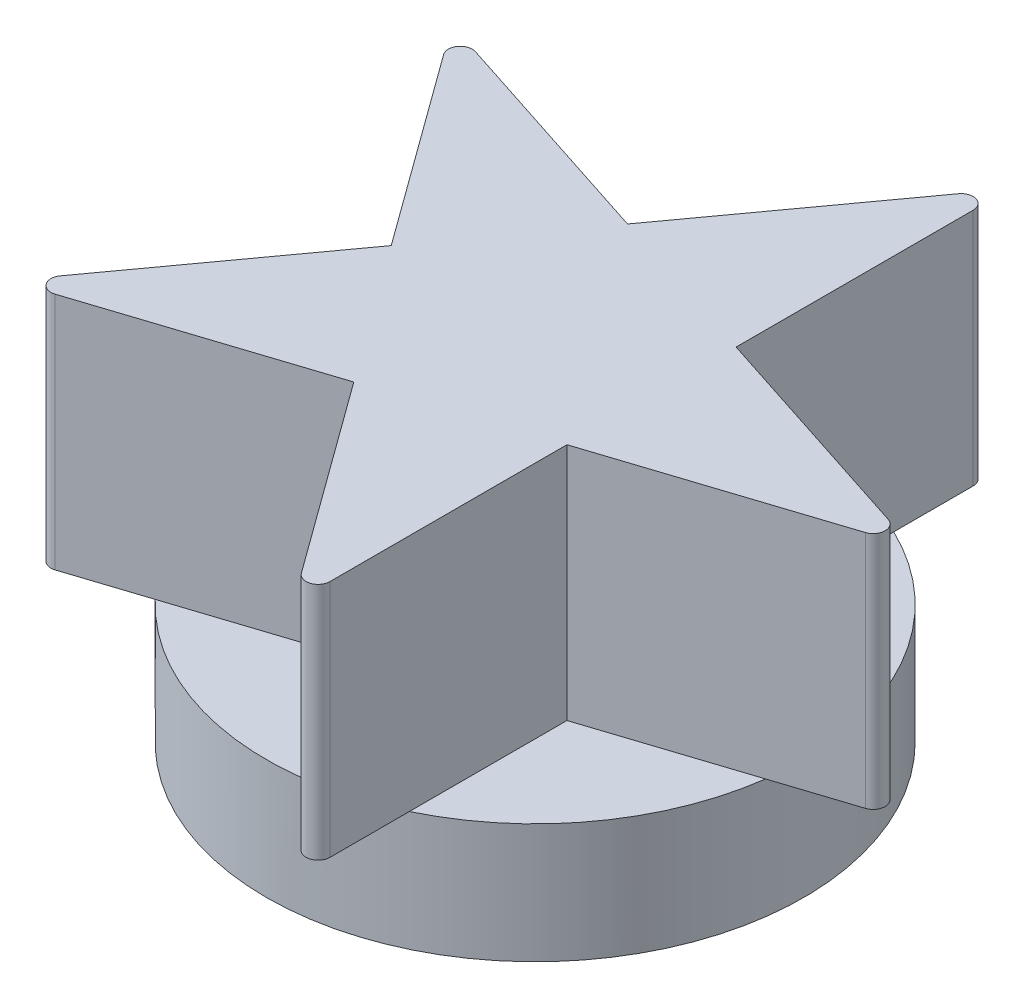
ISO-10303-21;
HEADER;
FILE_DESCRIPTION(('STEP AP214'),'2;1');
FILE_NAME('part.step','',(''),(''),'','','');
FILE_SCHEMA(('AUTOMOTIVE_DESIGN { 1 0 10303 214 1 1 1 1 }'));
ENDSEC;
DATA;
#1=APPLICATION_CONTEXT('core data for automotive mechanical design processes');
#2=APPLICATION_PROTOCOL_DEFINITION('international standard','automotive_design',2000,#1);
#3=PRODUCT_CONTEXT('',#1,'mechanical');
#4=PRODUCT('Part','Part','',(#3));
#5=PRODUCT_RELATED_PRODUCT_CATEGORY('part','',(#4));
#6=PRODUCT_DEFINITION_FORMATION('','',#4);
#7=PRODUCT_DEFINITION_CONTEXT('part definition',#1,'design');
#8=PRODUCT_DEFINITION('design','',#6,#7);
#9=PRODUCT_DEFINITION_SHAPE('','',#8);
#10=(LENGTH_UNIT() NAMED_UNIT(*) SI_UNIT(.MILLI.,.METRE.));
#11=(NAMED_UNIT(*) PLANE_ANGLE_UNIT() SI_UNIT($,.RADIAN.));
#12=(NAMED_UNIT(*) SI_UNIT($,.STERADIAN.) SOLID_ANGLE_UNIT());
#13=UNCERTAINTY_MEASURE_WITH_UNIT(LENGTH_MEASURE(1.E-05),#10,'distance_accuracy_value','');
#14=(GEOMETRIC_REPRESENTATION_CONTEXT(3) GLOBAL_UNCERTAINTY_ASSIGNED_CONTEXT((#13)) GLOBAL_UNIT_ASSIGNED_CONTEXT((#10,
#11,#12)) REPRESENTATION_CONTEXT('',''));
#15=CARTESIAN_POINT('',(0.,0.,0.));
#16=DIRECTION('',(0.,0.,1.));
#17=DIRECTION('',(1.,0.,0.));
#18=AXIS2_PLACEMENT_3D('',#15,#16,#17);
#19=CARTESIAN_POINT('',(0.,10.,0.));
#20=DIRECTION('',(0.,1.,0.));
#21=DIRECTION('',(0.,0.,1.));
#22=AXIS2_PLACEMENT_3D('',#19,#20,#21);
#23=PLANE('',#22);
#24=DIRECTION('',(-0.587785252292473,0.,0.809016994374947));
#25=VECTOR('',#24,1.);
#26=CARTESIAN_POINT('',(-23.7105072561862,10.,16.051121377614));
#27=LINE('',#26,#25);
#28=CARTESIAN_POINT('',(-12.0486849531736,10.,0.));
#29=VERTEX_POINT('',#28);
#30=CARTESIAN_POINT('',(-19.805614986373,10.,10.6764982560555));
#31=VERTEX_POINT('',#30);
#32=EDGE_CURVE('E67',#29,#31,#27,.T.);
#33=ORIENTED_EDGE('',*,*,#32,.F.);
#34=DIRECTION('',(0.587785252292473,0.,0.809016994374947));
#35=VECTOR('',#34,1.);
#36=CARTESIAN_POINT('',(-23.7105072561862,10.,-16.0511213776141));
#37=LINE('',#36,#35);
#38=CARTESIAN_POINT('',(-19.805614986373,10.,-10.6764982560555));
#39=VERTEX_POINT('',#38);
#40=EDGE_CURVE('E11',#39,#29,#37,.T.);
#41=ORIENTED_EDGE('',*,*,#40,.F.);
#42=CARTESIAN_POINT('',(0.,10.,0.));
#43=DIRECTION('',(0.,1.,0.));
#44=DIRECTION('',(0.,0.,1.));
#45=AXIS2_PLACEMENT_3D('',#42,#43,#44);
#46=CIRCLE('',#45,22.5);
#47=EDGE_CURVE('E377',#39,#31,#46,.T.);
#48=ORIENTED_EDGE('',*,*,#47,.T.);
#49=EDGE_LOOP('',(#33,#41,#48));
#50=FACE_BOUND('',#49,.T.);
#51=ADVANCED_FACE('F41',(#50),#23,.T.);
#52=DIRECTION('',(-0.951056516295153,0.,-0.309016994374947));
#53=VECTOR('',#52,1.);
#54=CARTESIAN_POINT('',(-3.72324841040035,10.,-11.4589803375032));
#55=LINE('',#54,#53);
#56=CARTESIAN_POINT('',(-3.72324841040035,10.,-11.4589803375032));
#57=VERTEX_POINT('',#56);
#58=CARTESIAN_POINT('',(-16.2742248524718,10.,-15.5370397904874));
#59=VERTEX_POINT('',#58);
#60=EDGE_CURVE('E313',#57,#59,#55,.T.);
#61=ORIENTED_EDGE('',*,*,#60,.F.);
#62=DIRECTION('',(-0.587785252292473,0.,0.809016994374948));
#63=VECTOR('',#62,1.);
#64=CARTESIAN_POINT('',(-3.72324841040035,10.,-11.4589803375032));
#65=LINE('',#64,#63);
#66=CARTESIAN_POINT('',(4.03368162279902,10.,-22.1354785935587));
#67=VERTEX_POINT('',#66);
#68=EDGE_CURVE('E50',#67,#57,#65,.T.);
#69=ORIENTED_EDGE('',*,*,#68,.F.);
#70=EDGE_CURVE('E699',#67,#59,#46,.T.);
#71=ORIENTED_EDGE('',*,*,#70,.T.);
#72=EDGE_LOOP('',(#61,#69,#71));
#73=FACE_BOUND('',#72,.T.);
#74=ADVANCED_FACE('F399',(#73),#23,.T.);
#75=DIRECTION('',(0.,0.,-1.));
#76=VECTOR('',#75,1.);
#77=CARTESIAN_POINT('',(9.7475908869872,10.,-26.9223164628247));
#78=LINE('',#77,#76);
#79=CARTESIAN_POINT('',(9.7475908869872,10.,-7.0820393249937));
#80=VERTEX_POINT('',#79);
#81=CARTESIAN_POINT('',(9.7475908869872,10.,-20.2789169311362));
#82=VERTEX_POINT('',#81);
#83=EDGE_CURVE('E304',#80,#82,#78,.T.);
#84=ORIENTED_EDGE('',*,*,#83,.F.);
#85=DIRECTION('',(-0.951056516295154,0.,-0.309016994374948));
#86=VECTOR('',#85,1.);
#87=CARTESIAN_POINT('',(28.6168157440231,10.,-0.951056516295165));
#88=LINE('',#87,#86);
#89=CARTESIAN_POINT('',(22.2985673290587,10.,-3.00397987200947));
#90=VERTEX_POINT('',#89);
#91=EDGE_CURVE('E303',#90,#80,#88,.T.);
#92=ORIENTED_EDGE('',*,*,#91,.F.);
#93=EDGE_CURVE('E706',#90,#82,#46,.T.);
#94=ORIENTED_EDGE('',*,*,#93,.T.);
#95=EDGE_LOOP('',(#84,#92,#94));
#96=FACE_BOUND('',#95,.T.);
#97=ADVANCED_FACE('F403',(#96),#23,.T.);
#98=DIRECTION('',(0.951056516295154,0.,-0.309016994374947));
#99=VECTOR('',#98,1.);
#100=CARTESIAN_POINT('',(28.6168157440231,10.,0.951056516295165));
#101=LINE('',#100,#99);
#102=CARTESIAN_POINT('',(9.7475908869872,10.,7.08203932499369));
#103=VERTEX_POINT('',#102);
#104=CARTESIAN_POINT('',(22.2985673290586,10.,3.00397987200947));
#105=VERTEX_POINT('',#104);
#106=EDGE_CURVE('E294',#103,#105,#101,.T.);
#107=ORIENTED_EDGE('',*,*,#106,.F.);
#108=DIRECTION('',(0.,0.,-1.));
#109=VECTOR('',#108,1.);
#110=CARTESIAN_POINT('',(9.7475908869872,10.,7.08203932499369));
#111=LINE('',#110,#109);
#112=CARTESIAN_POINT('',(9.74759088698719,10.,20.2789169311362));
#113=VERTEX_POINT('',#112);
#114=EDGE_CURVE('E293',#113,#103,#111,.T.);
#115=ORIENTED_EDGE('',*,*,#114,.F.);
#116=EDGE_CURVE('E364',#113,#105,#46,.T.);
#117=ORIENTED_EDGE('',*,*,#116,.T.);
#118=EDGE_LOOP('',(#107,#115,#117));
#119=FACE_BOUND('',#118,.T.);
#120=ADVANCED_FACE('F397',(#119),#23,.T.);
#121=CARTESIAN_POINT('',(0.,10.,0.));
#122=DIRECTION('',(0.,-1.,0.));
#123=DIRECTION('',(0.,0.,-1.));
#124=AXIS2_PLACEMENT_3D('',#121,#122,#123);
#125=CYLINDRICAL_SURFACE('',#124,22.5);
#126=CARTESIAN_POINT('',(4.03368162279902,10.,22.1354785935587));
#127=VERTEX_POINT('',#126);
#128=EDGE_CURVE('E362',#127,#113,#46,.T.);
#129=ORIENTED_EDGE('',*,*,#128,.F.);
#130=CARTESIAN_POINT('',(-16.2742248524718,10.,15.5370397904874));
#131=VERTEX_POINT('',#130);
#132=EDGE_CURVE('E365',#131,#127,#46,.T.);
#133=ORIENTED_EDGE('',*,*,#132,.F.);
#134=EDGE_CURVE('E373',#31,#131,#46,.T.);
#135=ORIENTED_EDGE('',*,*,#134,.F.);
#136=ORIENTED_EDGE('',*,*,#47,.F.);
#137=EDGE_CURVE('E698',#59,#39,#46,.T.);
#138=ORIENTED_EDGE('',*,*,#137,.F.);
#139=ORIENTED_EDGE('',*,*,#70,.F.);
#140=EDGE_CURVE('E703',#82,#67,#46,.T.);
#141=ORIENTED_EDGE('',*,*,#140,.F.);
#142=ORIENTED_EDGE('',*,*,#93,.F.);
#143=EDGE_CURVE('E372',#105,#90,#46,.T.);
#144=ORIENTED_EDGE('',*,*,#143,.F.);
#145=ORIENTED_EDGE('',*,*,#116,.F.);
#146=EDGE_LOOP('',(#129,#133,#135,#136,#138,#139,#141,#142,#144,#145));
#147=FACE_BOUND('',#146,.T.);
#148=CARTESIAN_POINT('',(0.,0.,0.));
#149=DIRECTION('',(0.,1.,0.));
#150=DIRECTION('',(0.,0.,1.));
#151=AXIS2_PLACEMENT_3D('',#148,#149,#150);
#152=CIRCLE('',#151,22.5);
#153=CARTESIAN_POINT('',(0.,0.,22.5));
#154=VERTEX_POINT('',#153);
#155=EDGE_CURVE('E45',#154,#154,#152,.T.);
#156=ORIENTED_EDGE('',*,*,#155,.T.);
#157=EDGE_LOOP('',(#156));
#158=FACE_BOUND('',#157,.T.);
#159=ADVANCED_FACE('F43',(#147,#158),#125,.T.);
#160=DIRECTION('',(0.587785252292473,0.,0.809016994374948));
#161=VECTOR('',#160,1.);
#162=CARTESIAN_POINT('',(-3.72324841040036,10.,11.4589803375032));
#163=LINE('',#162,#161);
#164=CARTESIAN_POINT('',(-3.72324841040036,10.,11.4589803375032));
#165=VERTEX_POINT('',#164);
#166=EDGE_CURVE('E284',#165,#127,#163,.T.);
#167=ORIENTED_EDGE('',*,*,#166,.F.);
#168=DIRECTION('',(0.951056516295154,0.,-0.309016994374947));
#169=VECTOR('',#168,1.);
#170=CARTESIAN_POINT('',(-3.72324841040036,10.,11.4589803375032));
#171=LINE('',#170,#169);
#172=EDGE_CURVE('E283',#131,#165,#171,.T.);
#173=ORIENTED_EDGE('',*,*,#172,.F.);
#174=ORIENTED_EDGE('',*,*,#132,.T.);
#175=EDGE_LOOP('',(#167,#173,#174));
#176=FACE_BOUND('',#175,.T.);
#177=ADVANCED_FACE('F385',(#176),#23,.T.);
#178=CARTESIAN_POINT('',(0.,0.,0.));
#179=DIRECTION('',(0.,1.,0.));
#180=DIRECTION('',(0.,0.,1.));
#181=AXIS2_PLACEMENT_3D('',#178,#179,#180);
#182=PLANE('',#181);
#183=CARTESIAN_POINT('',(0.,0.,0.));
#184=DIRECTION('',(0.,-1.,0.));
#185=DIRECTION('',(0.,0.,-1.));
#186=AXIS2_PLACEMENT_3D('',#183,#184,#185);
#187=CIRCLE('',#186,21.5);
#188=CARTESIAN_POINT('',(4.83856503950974,0.,20.9484674465326));
#189=VERTEX_POINT('',#188);
#190=CARTESIAN_POINT('',(-4.83856503950294,0.,20.9484674465341));
#191=VERTEX_POINT('',#190);
#192=EDGE_CURVE('E234',#189,#191,#187,.T.);
#193=ORIENTED_EDGE('',*,*,#192,.F.);
#194=DIRECTION('',(-0.471428571428459,0.,0.881904247660097));
#195=VECTOR('',#194,1.);
#196=CARTESIAN_POINT('',(12.4726457883362,0.,6.66734693877418));
#197=LINE('',#196,#195);
#198=CARTESIAN_POINT('',(14.5514200863916,0.,2.77857142856957));
#199=VERTEX_POINT('',#198);
#200=EDGE_CURVE('E59',#199,#189,#197,.T.);
#201=ORIENTED_EDGE('',*,*,#200,.F.);
#202=CARTESIAN_POINT('',(0.,0.,-5.));
#203=DIRECTION('',(0.,-1.,0.));
#204=DIRECTION('',(0.,0.,-1.));
#205=AXIS2_PLACEMENT_3D('',#202,#203,#204);
#206=CIRCLE('',#205,16.5);
#207=CARTESIAN_POINT('',(-14.5514200863896,0.,2.77857142857328));
#208=VERTEX_POINT('',#207);
#209=EDGE_CURVE('E225',#208,#199,#206,.T.);
#210=ORIENTED_EDGE('',*,*,#209,.F.);
#211=DIRECTION('',(-0.471428571428684,0.,-0.881904247659977));
#212=VECTOR('',#211,1.);
#213=CARTESIAN_POINT('',(-12.4726457883335,0.,6.66734693877684));
#214=LINE('',#213,#212);
#215=EDGE_CURVE('E228',#191,#208,#214,.T.);
#216=ORIENTED_EDGE('',*,*,#215,.F.);
#217=EDGE_LOOP('',(#193,#201,#210,#216));
#218=FACE_BOUND('',#217,.T.);
#219=ORIENTED_EDGE('',*,*,#155,.F.);
#220=EDGE_LOOP('',(#219));
#221=FACE_BOUND('',#220,.T.);
#222=ADVANCED_FACE('F382',(#218,#221),#182,.F.);
#223=CARTESIAN_POINT('',(-22.9014902618113,10.,-16.6389066299066));
#224=DIRECTION('',(0.,1.,0.));
#225=DIRECTION('',(0.,0.,1.));
#226=AXIS2_PLACEMENT_3D('',#223,#224,#225);
#227=PLANE('',#226);
#228=CARTESIAN_POINT('',(7.93857389261222,10.,27.5101017151172));
#229=VERTEX_POINT('',#228);
#230=EDGE_CURVE('E282',#127,#229,#163,.T.);
#231=ORIENTED_EDGE('',*,*,#230,.F.);
#232=ORIENTED_EDGE('',*,*,#128,.T.);
#233=CARTESIAN_POINT('',(9.74759088698719,10.,26.9223164628247));
#234=VERTEX_POINT('',#233);
#235=EDGE_CURVE('E289',#234,#113,#111,.T.);
#236=ORIENTED_EDGE('',*,*,#235,.F.);
#237=CARTESIAN_POINT('',(8.74759088698719,10.,26.9223164628247));
#238=DIRECTION('',(0.,1.,0.));
#239=DIRECTION('',(0.,0.,-1.));
#240=AXIS2_PLACEMENT_3D('',#237,#238,#239);
#241=CIRCLE('',#240,1.);
#242=EDGE_CURVE('E287',#229,#234,#241,.T.);
#243=ORIENTED_EDGE('',*,*,#242,.F.);
#244=EDGE_LOOP('',(#231,#232,#236,#243));
#245=FACE_BOUND('',#244,.T.);
#246=ADVANCED_FACE('F384',(#245),#227,.F.);
#247=CARTESIAN_POINT('',(28.6168157440231,10.,0.951056516295165));
#248=VERTEX_POINT('',#247);
#249=EDGE_CURVE('E292',#105,#248,#101,.T.);
#250=ORIENTED_EDGE('',*,*,#249,.F.);
#251=ORIENTED_EDGE('',*,*,#143,.T.);
#252=CARTESIAN_POINT('',(28.6168157440231,10.,-0.951056516295165));
#253=VERTEX_POINT('',#252);
#254=EDGE_CURVE('E299',#253,#90,#88,.T.);
#255=ORIENTED_EDGE('',*,*,#254,.F.);
#256=CARTESIAN_POINT('',(28.3077987496482,10.,0.));
#257=DIRECTION('',(0.,1.,0.));
#258=DIRECTION('',(0.,0.,-1.));
#259=AXIS2_PLACEMENT_3D('',#256,#257,#258);
#260=CIRCLE('',#259,1.);
#261=EDGE_CURVE('E297',#248,#253,#260,.T.);
#262=ORIENTED_EDGE('',*,*,#261,.F.);
#263=EDGE_LOOP('',(#250,#251,#255,#262));
#264=FACE_BOUND('',#263,.T.);
#265=ADVANCED_FACE('F392',(#264),#227,.F.);
#266=CARTESIAN_POINT('',(9.7475908869872,10.,-26.9223164628247));
#267=VERTEX_POINT('',#266);
#268=EDGE_CURVE('E302',#82,#267,#78,.T.);
#269=ORIENTED_EDGE('',*,*,#268,.F.);
#270=ORIENTED_EDGE('',*,*,#140,.T.);
#271=CARTESIAN_POINT('',(7.93857389261223,10.,-27.5101017151172));
#272=VERTEX_POINT('',#271);
#273=EDGE_CURVE('E309',#272,#67,#65,.T.);
#274=ORIENTED_EDGE('',*,*,#273,.F.);
#275=CARTESIAN_POINT('',(8.7475908869872,10.,-26.9223164628248));
#276=DIRECTION('',(0.,1.,0.));
#277=DIRECTION('',(0.,0.,1.));
#278=AXIS2_PLACEMENT_3D('',#275,#276,#277);
#279=CIRCLE('',#278,1.);
#280=EDGE_CURVE('E307',#267,#272,#279,.T.);
#281=ORIENTED_EDGE('',*,*,#280,.F.);
#282=EDGE_LOOP('',(#269,#270,#274,#281));
#283=FACE_BOUND('',#282,.T.);
#284=ADVANCED_FACE('F618',(#283),#227,.F.);
#285=CARTESIAN_POINT('',(-22.5924732674363,10.,-17.5899631462017));
#286=VERTEX_POINT('',#285);
#287=EDGE_CURVE('E312',#59,#286,#55,.T.);
#288=ORIENTED_EDGE('',*,*,#287,.F.);
#289=ORIENTED_EDGE('',*,*,#137,.T.);
#290=CARTESIAN_POINT('',(-23.7105072561862,10.,-16.0511213776141));
#291=VERTEX_POINT('',#290);
#292=EDGE_CURVE('E52',#291,#39,#37,.T.);
#293=ORIENTED_EDGE('',*,*,#292,.F.);
#294=CARTESIAN_POINT('',(-22.9014902618113,10.,-16.6389066299066));
#295=DIRECTION('',(0.,1.,0.));
#296=DIRECTION('',(0.,0.,1.));
#297=AXIS2_PLACEMENT_3D('',#294,#295,#296);
#298=CIRCLE('',#297,1.);
#299=EDGE_CURVE('E316',#286,#291,#298,.T.);
#300=ORIENTED_EDGE('',*,*,#299,.F.);
#301=EDGE_LOOP('',(#288,#289,#293,#300));
#302=FACE_BOUND('',#301,.T.);
#303=ADVANCED_FACE('F609',(#302),#227,.F.);
#304=CARTESIAN_POINT('',(-23.7105072561862,10.,16.051121377614));
#305=VERTEX_POINT('',#304);
#306=EDGE_CURVE('E240',#31,#305,#27,.T.);
#307=ORIENTED_EDGE('',*,*,#306,.F.);
#308=ORIENTED_EDGE('',*,*,#134,.T.);
#309=CARTESIAN_POINT('',(-22.5924732674363,10.,17.5899631462017));
#310=VERTEX_POINT('',#309);
#311=EDGE_CURVE('E279',#310,#131,#171,.T.);
#312=ORIENTED_EDGE('',*,*,#311,.F.);
#313=CARTESIAN_POINT('',(-22.9014902618113,10.,16.6389066299065));
#314=DIRECTION('',(0.,1.,0.));
#315=DIRECTION('',(0.,0.,-1.));
#316=AXIS2_PLACEMENT_3D('',#313,#314,#315);
#317=CIRCLE('',#316,0.999999999999999);
#318=EDGE_CURVE('E277',#305,#310,#317,.T.);
#319=ORIENTED_EDGE('',*,*,#318,.F.);
#320=EDGE_LOOP('',(#307,#308,#312,#319));
#321=FACE_BOUND('',#320,.T.);
#322=ADVANCED_FACE('F394',(#321),#227,.F.);
#323=CARTESIAN_POINT('',(-23.7105072561862,30.,16.051121377614));
#324=DIRECTION('',(0.809016994374947,0.,0.587785252292473));
#325=DIRECTION('',(0.587785252292473,0.,-0.809016994374948));
#326=AXIS2_PLACEMENT_3D('',#323,#324,#325);
#327=PLANE('',#326);
#328=ORIENTED_EDGE('',*,*,#32,.T.);
#329=ORIENTED_EDGE('',*,*,#306,.T.);
#330=DIRECTION('',(0.,-1.,0.));
#331=VECTOR('',#330,1.);
#332=CARTESIAN_POINT('',(-23.7105072561862,30.,16.051121377614));
#333=LINE('',#332,#331);
#334=CARTESIAN_POINT('',(-23.7105072561862,30.,16.051121377614));
#335=VERTEX_POINT('',#334);
#336=EDGE_CURVE('E360',#335,#305,#333,.T.);
#337=ORIENTED_EDGE('',*,*,#336,.F.);
#338=DIRECTION('',(-0.587785252292473,0.,0.809016994374947));
#339=VECTOR('',#338,1.);
#340=CARTESIAN_POINT('',(-23.7105072561862,30.,16.051121377614));
#341=LINE('',#340,#339);
#342=CARTESIAN_POINT('',(-12.0486849531736,30.,0.));
#343=VERTEX_POINT('',#342);
#344=EDGE_CURVE('E244',#343,#335,#341,.T.);
#345=ORIENTED_EDGE('',*,*,#344,.F.);
#346=DIRECTION('',(0.,-1.,0.));
#347=VECTOR('',#346,1.);
#348=CARTESIAN_POINT('',(-12.0486849531736,30.,0.));
#349=LINE('',#348,#347);
#350=EDGE_CURVE('E275',#343,#29,#349,.T.);
#351=ORIENTED_EDGE('',*,*,#350,.T.);
#352=EDGE_LOOP('',(#328,#329,#337,#345,#351));
#353=FACE_BOUND('',#352,.T.);
#354=ADVANCED_FACE('F406',(#353),#327,.F.);
#355=CARTESIAN_POINT('',(-22.9014902618113,30.,16.6389066299065));
#356=DIRECTION('',(0.,-1.,0.));
#357=DIRECTION('',(0.,0.,-1.));
#358=AXIS2_PLACEMENT_3D('',#355,#356,#357);
#359=CYLINDRICAL_SURFACE('',#358,0.999999999999999);
#360=ORIENTED_EDGE('',*,*,#318,.T.);
#361=DIRECTION('',(0.,-1.,0.));
#362=VECTOR('',#361,1.);
#363=CARTESIAN_POINT('',(-22.5924732674363,30.,17.5899631462017));
#364=LINE('',#363,#362);
#365=CARTESIAN_POINT('',(-22.5924732674363,30.,17.5899631462017));
#366=VERTEX_POINT('',#365);
#367=EDGE_CURVE('E357',#366,#310,#364,.T.);
#368=ORIENTED_EDGE('',*,*,#367,.F.);
#369=CARTESIAN_POINT('',(-22.9014902618113,30.,16.6389066299065));
#370=DIRECTION('',(0.,1.,0.));
#371=DIRECTION('',(0.,0.,-1.));
#372=AXIS2_PLACEMENT_3D('',#369,#370,#371);
#373=CIRCLE('',#372,0.999999999999999);
#374=EDGE_CURVE('E247',#335,#366,#373,.T.);
#375=ORIENTED_EDGE('',*,*,#374,.F.);
#376=ORIENTED_EDGE('',*,*,#336,.T.);
#377=EDGE_LOOP('',(#360,#368,#375,#376));
#378=FACE_BOUND('',#377,.T.);
#379=ADVANCED_FACE('F409',(#378),#359,.T.);
#380=CARTESIAN_POINT('',(-3.72324841040036,30.,11.4589803375032));
#381=DIRECTION('',(-0.309016994374947,0.,-0.951056516295154));
#382=DIRECTION('',(-0.951056516295154,0.,0.309016994374947));
#383=AXIS2_PLACEMENT_3D('',#380,#381,#382);
#384=PLANE('',#383);
#385=ORIENTED_EDGE('',*,*,#311,.T.);
#386=ORIENTED_EDGE('',*,*,#172,.T.);
#387=DIRECTION('',(0.,-1.,0.));
#388=VECTOR('',#387,1.);
#389=CARTESIAN_POINT('',(-3.72324841040036,30.,11.4589803375032));
#390=LINE('',#389,#388);
#391=CARTESIAN_POINT('',(-3.72324841040036,30.,11.4589803375032));
#392=VERTEX_POINT('',#391);
#393=EDGE_CURVE('E354',#392,#165,#390,.T.);
#394=ORIENTED_EDGE('',*,*,#393,.F.);
#395=DIRECTION('',(0.951056516295154,0.,-0.309016994374947));
#396=VECTOR('',#395,1.);
#397=CARTESIAN_POINT('',(-3.72324841040036,30.,11.4589803375032));
#398=LINE('',#397,#396);
#399=EDGE_CURVE('E249',#366,#392,#398,.T.);
#400=ORIENTED_EDGE('',*,*,#399,.F.);
#401=ORIENTED_EDGE('',*,*,#367,.T.);
#402=EDGE_LOOP('',(#385,#386,#394,#400,#401));
#403=FACE_BOUND('',#402,.T.);
#404=ADVANCED_FACE('F413',(#403),#384,.F.);
#405=CARTESIAN_POINT('',(-3.72324841040036,30.,11.4589803375032));
#406=DIRECTION('',(0.809016994374948,0.,-0.587785252292473));
#407=DIRECTION('',(-0.587785252292473,0.,-0.809016994374948));
#408=AXIS2_PLACEMENT_3D('',#405,#406,#407);
#409=PLANE('',#408);
#410=ORIENTED_EDGE('',*,*,#166,.T.);
#411=ORIENTED_EDGE('',*,*,#230,.T.);
#412=DIRECTION('',(0.,-1.,0.));
#413=VECTOR('',#412,1.);
#414=CARTESIAN_POINT('',(7.93857389261222,30.,27.5101017151172));
#415=LINE('',#414,#413);
#416=CARTESIAN_POINT('',(7.93857389261222,30.,27.5101017151172));
#417=VERTEX_POINT('',#416);
#418=EDGE_CURVE('E351',#417,#229,#415,.T.);
#419=ORIENTED_EDGE('',*,*,#418,.F.);
#420=DIRECTION('',(0.587785252292473,0.,0.809016994374948));
#421=VECTOR('',#420,1.);
#422=CARTESIAN_POINT('',(-3.72324841040036,30.,11.4589803375032));
#423=LINE('',#422,#421);
#424=EDGE_CURVE('E251',#392,#417,#423,.T.);
#425=ORIENTED_EDGE('',*,*,#424,.F.);
#426=ORIENTED_EDGE('',*,*,#393,.T.);
#427=EDGE_LOOP('',(#410,#411,#419,#425,#426));
#428=FACE_BOUND('',#427,.T.);
#429=ADVANCED_FACE('F417',(#428),#409,.F.);
#430=CARTESIAN_POINT('',(8.74759088698719,30.,26.9223164628247));
#431=DIRECTION('',(0.,-1.,0.));
#432=DIRECTION('',(0.,0.,-1.));
#433=AXIS2_PLACEMENT_3D('',#430,#431,#432);
#434=CYLINDRICAL_SURFACE('',#433,1.);
#435=ORIENTED_EDGE('',*,*,#242,.T.);
#436=DIRECTION('',(0.,-1.,0.));
#437=VECTOR('',#436,1.);
#438=CARTESIAN_POINT('',(9.74759088698719,30.,26.9223164628247));
#439=LINE('',#438,#437);
#440=CARTESIAN_POINT('',(9.74759088698719,30.,26.9223164628247));
#441=VERTEX_POINT('',#440);
#442=EDGE_CURVE('E348',#441,#234,#439,.T.);
#443=ORIENTED_EDGE('',*,*,#442,.F.);
#444=CARTESIAN_POINT('',(8.74759088698719,30.,26.9223164628247));
#445=DIRECTION('',(0.,1.,0.));
#446=DIRECTION('',(0.,0.,-1.));
#447=AXIS2_PLACEMENT_3D('',#444,#445,#446);
#448=CIRCLE('',#447,1.);
#449=EDGE_CURVE('E253',#417,#441,#448,.T.);
#450=ORIENTED_EDGE('',*,*,#449,.F.);
#451=ORIENTED_EDGE('',*,*,#418,.T.);
#452=EDGE_LOOP('',(#435,#443,#450,#451));
#453=FACE_BOUND('',#452,.T.);
#454=ADVANCED_FACE('F421',(#453),#434,.T.);
#455=CARTESIAN_POINT('',(9.7475908869872,30.,7.08203932499369));
#456=DIRECTION('',(-1.,0.,0.));
#457=DIRECTION('',(0.,0.,1.));
#458=AXIS2_PLACEMENT_3D('',#455,#456,#457);
#459=PLANE('',#458);
#460=ORIENTED_EDGE('',*,*,#235,.T.);
#461=ORIENTED_EDGE('',*,*,#114,.T.);
#462=DIRECTION('',(0.,-1.,0.));
#463=VECTOR('',#462,1.);
#464=CARTESIAN_POINT('',(9.7475908869872,30.,7.08203932499369));
#465=LINE('',#464,#463);
#466=CARTESIAN_POINT('',(9.7475908869872,30.,7.08203932499369));
#467=VERTEX_POINT('',#466);
#468=EDGE_CURVE('E345',#467,#103,#465,.T.);
#469=ORIENTED_EDGE('',*,*,#468,.F.);
#470=DIRECTION('',(0.,0.,-1.));
#471=VECTOR('',#470,1.);
#472=CARTESIAN_POINT('',(9.7475908869872,30.,7.08203932499369));
#473=LINE('',#472,#471);
#474=EDGE_CURVE('E255',#441,#467,#473,.T.);
#475=ORIENTED_EDGE('',*,*,#474,.F.);
#476=ORIENTED_EDGE('',*,*,#442,.T.);
#477=EDGE_LOOP('',(#460,#461,#469,#475,#476));
#478=FACE_BOUND('',#477,.T.);
#479=ADVANCED_FACE('F425',(#478),#459,.F.);
#480=CARTESIAN_POINT('',(28.6168157440231,30.,0.951056516295165));
#481=DIRECTION('',(-0.309016994374947,0.,-0.951056516295154));
#482=DIRECTION('',(-0.951056516295154,0.,0.309016994374947));
#483=AXIS2_PLACEMENT_3D('',#480,#481,#482);
#484=PLANE('',#483);
#485=ORIENTED_EDGE('',*,*,#106,.T.);
#486=ORIENTED_EDGE('',*,*,#249,.T.);
#487=DIRECTION('',(0.,-1.,0.));
#488=VECTOR('',#487,1.);
#489=CARTESIAN_POINT('',(28.6168157440231,30.,0.951056516295165));
#490=LINE('',#489,#488);
#491=CARTESIAN_POINT('',(28.6168157440231,30.,0.951056516295165));
#492=VERTEX_POINT('',#491);
#493=EDGE_CURVE('E342',#492,#248,#490,.T.);
#494=ORIENTED_EDGE('',*,*,#493,.F.);
#495=DIRECTION('',(0.951056516295154,0.,-0.309016994374947));
#496=VECTOR('',#495,1.);
#497=CARTESIAN_POINT('',(28.6168157440231,30.,0.951056516295165));
#498=LINE('',#497,#496);
#499=EDGE_CURVE('E257',#467,#492,#498,.T.);
#500=ORIENTED_EDGE('',*,*,#499,.F.);
#501=ORIENTED_EDGE('',*,*,#468,.T.);
#502=EDGE_LOOP('',(#485,#486,#494,#500,#501));
#503=FACE_BOUND('',#502,.T.);
#504=ADVANCED_FACE('F429',(#503),#484,.F.);
#505=CARTESIAN_POINT('',(28.3077987496482,30.,0.));
#506=DIRECTION('',(0.,-1.,0.));
#507=DIRECTION('',(0.,0.,-1.));
#508=AXIS2_PLACEMENT_3D('',#505,#506,#507);
#509=CYLINDRICAL_SURFACE('',#508,1.);
#510=ORIENTED_EDGE('',*,*,#261,.T.);
#511=DIRECTION('',(0.,-1.,0.));
#512=VECTOR('',#511,1.);
#513=CARTESIAN_POINT('',(28.6168157440231,30.,-0.951056516295165));
#514=LINE('',#513,#512);
#515=CARTESIAN_POINT('',(28.6168157440231,30.,-0.951056516295165));
#516=VERTEX_POINT('',#515);
#517=EDGE_CURVE('E339',#516,#253,#514,.T.);
#518=ORIENTED_EDGE('',*,*,#517,.F.);
#519=CARTESIAN_POINT('',(28.3077987496482,30.,0.));
#520=DIRECTION('',(0.,1.,0.));
#521=DIRECTION('',(0.,0.,-1.));
#522=AXIS2_PLACEMENT_3D('',#519,#520,#521);
#523=CIRCLE('',#522,1.);
#524=EDGE_CURVE('E259',#492,#516,#523,.T.);
#525=ORIENTED_EDGE('',*,*,#524,.F.);
#526=ORIENTED_EDGE('',*,*,#493,.T.);
#527=EDGE_LOOP('',(#510,#518,#525,#526));
#528=FACE_BOUND('',#527,.T.);
#529=ADVANCED_FACE('F433',(#528),#509,.T.);
#530=CARTESIAN_POINT('',(28.6168157440231,30.,-0.951056516295165));
#531=DIRECTION('',(-0.309016994374948,0.,0.951056516295154));
#532=DIRECTION('',(0.951056516295154,0.,0.309016994374948));
#533=AXIS2_PLACEMENT_3D('',#530,#531,#532);
#534=PLANE('',#533);
#535=ORIENTED_EDGE('',*,*,#254,.T.);
#536=ORIENTED_EDGE('',*,*,#91,.T.);
#537=DIRECTION('',(0.,-1.,0.));
#538=VECTOR('',#537,1.);
#539=CARTESIAN_POINT('',(9.7475908869872,30.,-7.0820393249937));
#540=LINE('',#539,#538);
#541=CARTESIAN_POINT('',(9.7475908869872,30.,-7.0820393249937));
#542=VERTEX_POINT('',#541);
#543=EDGE_CURVE('E336',#542,#80,#540,.T.);
#544=ORIENTED_EDGE('',*,*,#543,.F.);
#545=DIRECTION('',(-0.951056516295154,0.,-0.309016994374948));
#546=VECTOR('',#545,1.);
#547=CARTESIAN_POINT('',(28.6168157440231,30.,-0.951056516295165));
#548=LINE('',#547,#546);
#549=EDGE_CURVE('E261',#516,#542,#548,.T.);
#550=ORIENTED_EDGE('',*,*,#549,.F.);
#551=ORIENTED_EDGE('',*,*,#517,.T.);
#552=EDGE_LOOP('',(#535,#536,#544,#550,#551));
#553=FACE_BOUND('',#552,.T.);
#554=ADVANCED_FACE('F437',(#553),#534,.F.);
#555=CARTESIAN_POINT('',(9.7475908869872,30.,-26.9223164628247));
#556=DIRECTION('',(-1.,0.,0.));
#557=DIRECTION('',(0.,0.,1.));
#558=AXIS2_PLACEMENT_3D('',#555,#556,#557);
#559=PLANE('',#558);
#560=ORIENTED_EDGE('',*,*,#83,.T.);
#561=ORIENTED_EDGE('',*,*,#268,.T.);
#562=DIRECTION('',(0.,-1.,0.));
#563=VECTOR('',#562,1.);
#564=CARTESIAN_POINT('',(9.7475908869872,30.,-26.9223164628247));
#565=LINE('',#564,#563);
#566=CARTESIAN_POINT('',(9.7475908869872,30.,-26.9223164628247));
#567=VERTEX_POINT('',#566);
#568=EDGE_CURVE('E333',#567,#267,#565,.T.);
#569=ORIENTED_EDGE('',*,*,#568,.F.);
#570=DIRECTION('',(0.,0.,-1.));
#571=VECTOR('',#570,1.);
#572=CARTESIAN_POINT('',(9.7475908869872,30.,-26.9223164628247));
#573=LINE('',#572,#571);
#574=EDGE_CURVE('E263',#542,#567,#573,.T.);
#575=ORIENTED_EDGE('',*,*,#574,.F.);
#576=ORIENTED_EDGE('',*,*,#543,.T.);
#577=EDGE_LOOP('',(#560,#561,#569,#575,#576));
#578=FACE_BOUND('',#577,.T.);
#579=ADVANCED_FACE('F441',(#578),#559,.F.);
#580=CARTESIAN_POINT('',(8.7475908869872,30.,-26.9223164628248));
#581=DIRECTION('',(0.,-1.,0.));
#582=DIRECTION('',(0.,0.,-1.));
#583=AXIS2_PLACEMENT_3D('',#580,#581,#582);
#584=CYLINDRICAL_SURFACE('',#583,1.);
#585=ORIENTED_EDGE('',*,*,#280,.T.);
#586=DIRECTION('',(0.,-1.,0.));
#587=VECTOR('',#586,1.);
#588=CARTESIAN_POINT('',(7.93857389261223,30.,-27.5101017151172));
#589=LINE('',#588,#587);
#590=CARTESIAN_POINT('',(7.93857389261223,30.,-27.5101017151172));
#591=VERTEX_POINT('',#590);
#592=EDGE_CURVE('E330',#591,#272,#589,.T.);
#593=ORIENTED_EDGE('',*,*,#592,.F.);
#594=CARTESIAN_POINT('',(8.7475908869872,30.,-26.9223164628248));
#595=DIRECTION('',(0.,1.,0.));
#596=DIRECTION('',(0.,0.,1.));
#597=AXIS2_PLACEMENT_3D('',#594,#595,#596);
#598=CIRCLE('',#597,1.);
#599=EDGE_CURVE('E265',#567,#591,#598,.T.);
#600=ORIENTED_EDGE('',*,*,#599,.F.);
#601=ORIENTED_EDGE('',*,*,#568,.T.);
#602=EDGE_LOOP('',(#585,#593,#600,#601));
#603=FACE_BOUND('',#602,.T.);
#604=ADVANCED_FACE('F445',(#603),#584,.T.);
#605=CARTESIAN_POINT('',(-3.72324841040035,30.,-11.4589803375032));
#606=DIRECTION('',(0.809016994374948,0.,0.587785252292473));
#607=DIRECTION('',(0.587785252292473,0.,-0.809016994374948));
#608=AXIS2_PLACEMENT_3D('',#605,#606,#607);
#609=PLANE('',#608);
#610=ORIENTED_EDGE('',*,*,#273,.T.);
#611=ORIENTED_EDGE('',*,*,#68,.T.);
#612=DIRECTION('',(0.,-1.,0.));
#613=VECTOR('',#612,1.);
#614=CARTESIAN_POINT('',(-3.72324841040035,30.,-11.4589803375032));
#615=LINE('',#614,#613);
#616=CARTESIAN_POINT('',(-3.72324841040035,30.,-11.4589803375032));
#617=VERTEX_POINT('',#616);
#618=EDGE_CURVE('E327',#617,#57,#615,.T.);
#619=ORIENTED_EDGE('',*,*,#618,.F.);
#620=DIRECTION('',(-0.587785252292473,0.,0.809016994374948));
#621=VECTOR('',#620,1.);
#622=CARTESIAN_POINT('',(-3.72324841040035,30.,-11.4589803375032));
#623=LINE('',#622,#621);
#624=EDGE_CURVE('E267',#591,#617,#623,.T.);
#625=ORIENTED_EDGE('',*,*,#624,.F.);
#626=ORIENTED_EDGE('',*,*,#592,.T.);
#627=EDGE_LOOP('',(#610,#611,#619,#625,#626));
#628=FACE_BOUND('',#627,.T.);
#629=ADVANCED_FACE('F449',(#628),#609,.F.);
#630=CARTESIAN_POINT('',(-3.72324841040035,30.,-11.4589803375032));
#631=DIRECTION('',(-0.309016994374947,0.,0.951056516295154));
#632=DIRECTION('',(0.951056516295154,0.,0.309016994374947));
#633=AXIS2_PLACEMENT_3D('',#630,#631,#632);
#634=PLANE('',#633);
#635=ORIENTED_EDGE('',*,*,#60,.T.);
#636=ORIENTED_EDGE('',*,*,#287,.T.);
#637=DIRECTION('',(0.,-1.,0.));
#638=VECTOR('',#637,1.);
#639=CARTESIAN_POINT('',(-22.5924732674363,30.,-17.5899631462017));
#640=LINE('',#639,#638);
#641=CARTESIAN_POINT('',(-22.5924732674363,30.,-17.5899631462017));
#642=VERTEX_POINT('',#641);
#643=EDGE_CURVE('E324',#642,#286,#640,.T.);
#644=ORIENTED_EDGE('',*,*,#643,.F.);
#645=DIRECTION('',(-0.951056516295153,0.,-0.309016994374947));
#646=VECTOR('',#645,1.);
#647=CARTESIAN_POINT('',(-3.72324841040035,30.,-11.4589803375032));
#648=LINE('',#647,#646);
#649=EDGE_CURVE('E269',#617,#642,#648,.T.);
#650=ORIENTED_EDGE('',*,*,#649,.F.);
#651=ORIENTED_EDGE('',*,*,#618,.T.);
#652=EDGE_LOOP('',(#635,#636,#644,#650,#651));
#653=FACE_BOUND('',#652,.T.);
#654=ADVANCED_FACE('F453',(#653),#634,.F.);
#655=CARTESIAN_POINT('',(-22.9014902618113,30.,-16.6389066299066));
#656=DIRECTION('',(0.,-1.,0.));
#657=DIRECTION('',(0.,0.,-1.));
#658=AXIS2_PLACEMENT_3D('',#655,#656,#657);
#659=CYLINDRICAL_SURFACE('',#658,1.);
#660=ORIENTED_EDGE('',*,*,#299,.T.);
#661=DIRECTION('',(0.,-1.,0.));
#662=VECTOR('',#661,1.);
#663=CARTESIAN_POINT('',(-23.7105072561862,30.,-16.0511213776141));
#664=LINE('',#663,#662);
#665=CARTESIAN_POINT('',(-23.7105072561862,30.,-16.0511213776141));
#666=VERTEX_POINT('',#665);
#667=EDGE_CURVE('E321',#666,#291,#664,.T.);
#668=ORIENTED_EDGE('',*,*,#667,.F.);
#669=CARTESIAN_POINT('',(-22.9014902618113,30.,-16.6389066299066));
#670=DIRECTION('',(0.,1.,0.));
#671=DIRECTION('',(0.,0.,1.));
#672=AXIS2_PLACEMENT_3D('',#669,#670,#671);
#673=CIRCLE('',#672,1.);
#674=EDGE_CURVE('E271',#642,#666,#673,.T.);
#675=ORIENTED_EDGE('',*,*,#674,.F.);
#676=ORIENTED_EDGE('',*,*,#643,.T.);
#677=EDGE_LOOP('',(#660,#668,#675,#676));
#678=FACE_BOUND('',#677,.T.);
#679=ADVANCED_FACE('F457',(#678),#659,.T.);
#680=CARTESIAN_POINT('',(-23.7105072561862,30.,-16.0511213776141));
#681=DIRECTION('',(0.809016994374947,0.,-0.587785252292473));
#682=DIRECTION('',(-0.587785252292473,0.,-0.809016994374948));
#683=AXIS2_PLACEMENT_3D('',#680,#681,#682);
#684=PLANE('',#683);
#685=ORIENTED_EDGE('',*,*,#292,.T.);
#686=ORIENTED_EDGE('',*,*,#40,.T.);
#687=ORIENTED_EDGE('',*,*,#350,.F.);
#688=DIRECTION('',(0.587785252292473,0.,0.809016994374947));
#689=VECTOR('',#688,1.);
#690=CARTESIAN_POINT('',(-23.7105072561862,30.,-16.0511213776141));
#691=LINE('',#690,#689);
#692=EDGE_CURVE('E273',#666,#343,#691,.T.);
#693=ORIENTED_EDGE('',*,*,#692,.F.);
#694=ORIENTED_EDGE('',*,*,#667,.T.);
#695=EDGE_LOOP('',(#685,#686,#687,#693,#694));
#696=FACE_BOUND('',#695,.T.);
#697=ADVANCED_FACE('F461',(#696),#684,.F.);
#698=CARTESIAN_POINT('',(-22.9014902618113,30.,-16.6389066299066));
#699=DIRECTION('',(0.,1.,0.));
#700=DIRECTION('',(0.,0.,1.));
#701=AXIS2_PLACEMENT_3D('',#698,#699,#700);
#702=PLANE('',#701);
#703=ORIENTED_EDGE('',*,*,#344,.T.);
#704=ORIENTED_EDGE('',*,*,#374,.T.);
#705=ORIENTED_EDGE('',*,*,#399,.T.);
#706=ORIENTED_EDGE('',*,*,#424,.T.);
#707=ORIENTED_EDGE('',*,*,#449,.T.);
#708=ORIENTED_EDGE('',*,*,#474,.T.);
#709=ORIENTED_EDGE('',*,*,#499,.T.);
#710=ORIENTED_EDGE('',*,*,#524,.T.);
#711=ORIENTED_EDGE('',*,*,#549,.T.);
#712=ORIENTED_EDGE('',*,*,#574,.T.);
#713=ORIENTED_EDGE('',*,*,#599,.T.);
#714=ORIENTED_EDGE('',*,*,#624,.T.);
#715=ORIENTED_EDGE('',*,*,#649,.T.);
#716=ORIENTED_EDGE('',*,*,#674,.T.);
#717=ORIENTED_EDGE('',*,*,#692,.T.);
#718=EDGE_LOOP('',(#703,#704,#705,#706,#707,#708,#709,#710,#711,#712,#713,#714,#715,#716,#717));
#719=FACE_BOUND('',#718,.T.);
#720=ADVANCED_FACE('F464',(#719),#702,.T.);
#721=CARTESIAN_POINT('',(12.4726457883362,5.,6.66734693877418));
#722=DIRECTION('',(0.881904247660097,0.,0.471428571428459));
#723=DIRECTION('',(0.471428571428459,0.,-0.881904247660097));
#724=AXIS2_PLACEMENT_3D('',#721,#722,#723);
#725=PLANE('',#724);
#726=ORIENTED_EDGE('',*,*,#200,.T.);
#727=DIRECTION('',(0.,-1.,0.));
#728=VECTOR('',#727,1.);
#729=CARTESIAN_POINT('',(4.83856503950974,5.,20.9484674465326));
#730=LINE('',#729,#728);
#731=CARTESIAN_POINT('',(4.83856503950974,5.,20.9484674465326));
#732=VERTEX_POINT('',#731);
#733=EDGE_CURVE('E203',#732,#189,#730,.T.);
#734=ORIENTED_EDGE('',*,*,#733,.F.);
#735=DIRECTION('',(-0.471428571428459,0.,0.881904247660097));
#736=VECTOR('',#735,1.);
#737=CARTESIAN_POINT('',(12.4726457883362,5.,6.66734693877418));
#738=LINE('',#737,#736);
#739=CARTESIAN_POINT('',(14.5514200863916,5.,2.77857142856957));
#740=VERTEX_POINT('',#739);
#741=EDGE_CURVE('E207',#740,#732,#738,.T.);
#742=ORIENTED_EDGE('',*,*,#741,.F.);
#743=DIRECTION('',(0.,-1.,0.));
#744=VECTOR('',#743,1.);
#745=CARTESIAN_POINT('',(14.5514200863916,5.,2.77857142856957));
#746=LINE('',#745,#744);
#747=EDGE_CURVE('E238',#740,#199,#746,.T.);
#748=ORIENTED_EDGE('',*,*,#747,.T.);
#749=EDGE_LOOP('',(#726,#734,#742,#748));
#750=FACE_BOUND('',#749,.T.);
#751=ADVANCED_FACE('F205',(#750),#725,.F.);
#752=CARTESIAN_POINT('',(0.,5.,-5.));
#753=DIRECTION('',(0.,-1.,0.));
#754=DIRECTION('',(0.,0.,-1.));
#755=AXIS2_PLACEMENT_3D('',#752,#753,#754);
#756=CYLINDRICAL_SURFACE('',#755,16.5);
#757=ORIENTED_EDGE('',*,*,#209,.T.);
#758=ORIENTED_EDGE('',*,*,#747,.F.);
#759=CARTESIAN_POINT('',(0.,5.,-5.));
#760=DIRECTION('',(0.,-1.,0.));
#761=DIRECTION('',(0.,0.,-1.));
#762=AXIS2_PLACEMENT_3D('',#759,#760,#761);
#763=CIRCLE('',#762,16.5);
#764=CARTESIAN_POINT('',(-14.5514200863896,5.,2.77857142857328));
#765=VERTEX_POINT('',#764);
#766=EDGE_CURVE('E213',#765,#740,#763,.T.);
#767=ORIENTED_EDGE('',*,*,#766,.F.);
#768=DIRECTION('',(0.,-1.,0.));
#769=VECTOR('',#768,1.);
#770=CARTESIAN_POINT('',(-14.5514200863896,5.,2.77857142857328));
#771=LINE('',#770,#769);
#772=EDGE_CURVE('E241',#765,#208,#771,.T.);
#773=ORIENTED_EDGE('',*,*,#772,.T.);
#774=EDGE_LOOP('',(#757,#758,#767,#773));
#775=FACE_BOUND('',#774,.T.);
#776=ADVANCED_FACE('F470',(#775),#756,.F.);
#777=CARTESIAN_POINT('',(-12.4726457883335,5.,6.66734693877684));
#778=DIRECTION('',(-0.881904247659977,0.,0.471428571428684));
#779=DIRECTION('',(0.471428571428684,0.,0.881904247659977));
#780=AXIS2_PLACEMENT_3D('',#777,#778,#779);
#781=PLANE('',#780);
#782=ORIENTED_EDGE('',*,*,#215,.T.);
#783=ORIENTED_EDGE('',*,*,#772,.F.);
#784=DIRECTION('',(-0.471428571428684,0.,-0.881904247659977));
#785=VECTOR('',#784,1.);
#786=CARTESIAN_POINT('',(-12.4726457883335,5.,6.66734693877684));
#787=LINE('',#786,#785);
#788=CARTESIAN_POINT('',(-4.83856503950294,5.,20.9484674465341));
#789=VERTEX_POINT('',#788);
#790=EDGE_CURVE('E221',#789,#765,#787,.T.);
#791=ORIENTED_EDGE('',*,*,#790,.F.);
#792=DIRECTION('',(0.,-1.,0.));
#793=VECTOR('',#792,1.);
#794=CARTESIAN_POINT('',(-4.83856503950294,5.,20.9484674465341));
#795=LINE('',#794,#793);
#796=EDGE_CURVE('E212',#789,#191,#795,.T.);
#797=ORIENTED_EDGE('',*,*,#796,.T.);
#798=EDGE_LOOP('',(#782,#783,#791,#797));
#799=FACE_BOUND('',#798,.T.);
#800=ADVANCED_FACE('F473',(#799),#781,.F.);
#801=CARTESIAN_POINT('',(0.,5.,0.));
#802=DIRECTION('',(0.,-1.,0.));
#803=DIRECTION('',(0.,0.,-1.));
#804=AXIS2_PLACEMENT_3D('',#801,#802,#803);
#805=CYLINDRICAL_SURFACE('',#804,21.5);
#806=ORIENTED_EDGE('',*,*,#192,.T.);
#807=ORIENTED_EDGE('',*,*,#796,.F.);
#808=CARTESIAN_POINT('',(0.,5.,0.));
#809=DIRECTION('',(0.,-1.,0.));
#810=DIRECTION('',(0.,0.,-1.));
#811=AXIS2_PLACEMENT_3D('',#808,#809,#810);
#812=CIRCLE('',#811,21.5);
#813=EDGE_CURVE('E216',#732,#789,#812,.T.);
#814=ORIENTED_EDGE('',*,*,#813,.F.);
#815=ORIENTED_EDGE('',*,*,#733,.T.);
#816=EDGE_LOOP('',(#806,#807,#814,#815));
#817=FACE_BOUND('',#816,.T.);
#818=ADVANCED_FACE('F217',(#817),#805,.F.);
#819=CARTESIAN_POINT('',(0.,5.,0.));
#820=DIRECTION('',(0.,-1.,0.));
#821=DIRECTION('',(0.,0.,-1.));
#822=AXIS2_PLACEMENT_3D('',#819,#820,#821);
#823=PLANE('',#822);
#824=ORIENTED_EDGE('',*,*,#741,.T.);
#825=ORIENTED_EDGE('',*,*,#813,.T.);
#826=ORIENTED_EDGE('',*,*,#790,.T.);
#827=ORIENTED_EDGE('',*,*,#766,.T.);
#828=EDGE_LOOP('',(#824,#825,#826,#827));
#829=FACE_BOUND('',#828,.T.);
#830=ADVANCED_FACE('F223',(#829),#823,.T.);
#831=CLOSED_SHELL('',(#51,#74,#97,#120,#159,#177,#222,#246,#265,#284,#303,#322,#354,#379,#404,
#429,#454,#479,#504,#529,#554,#579,#604,#629,#654,#679,#697,#720,#751,#776,#800,#818,#830));
#832=MANIFOLD_SOLID_BREP('B2',#831);
#833=ADVANCED_BREP_SHAPE_REPRESENTATION('',(#18,#832),#14);
#834=SHAPE_DEFINITION_REPRESENTATION(#9,#833);
ENDSEC;
END-ISO-10303-21;
